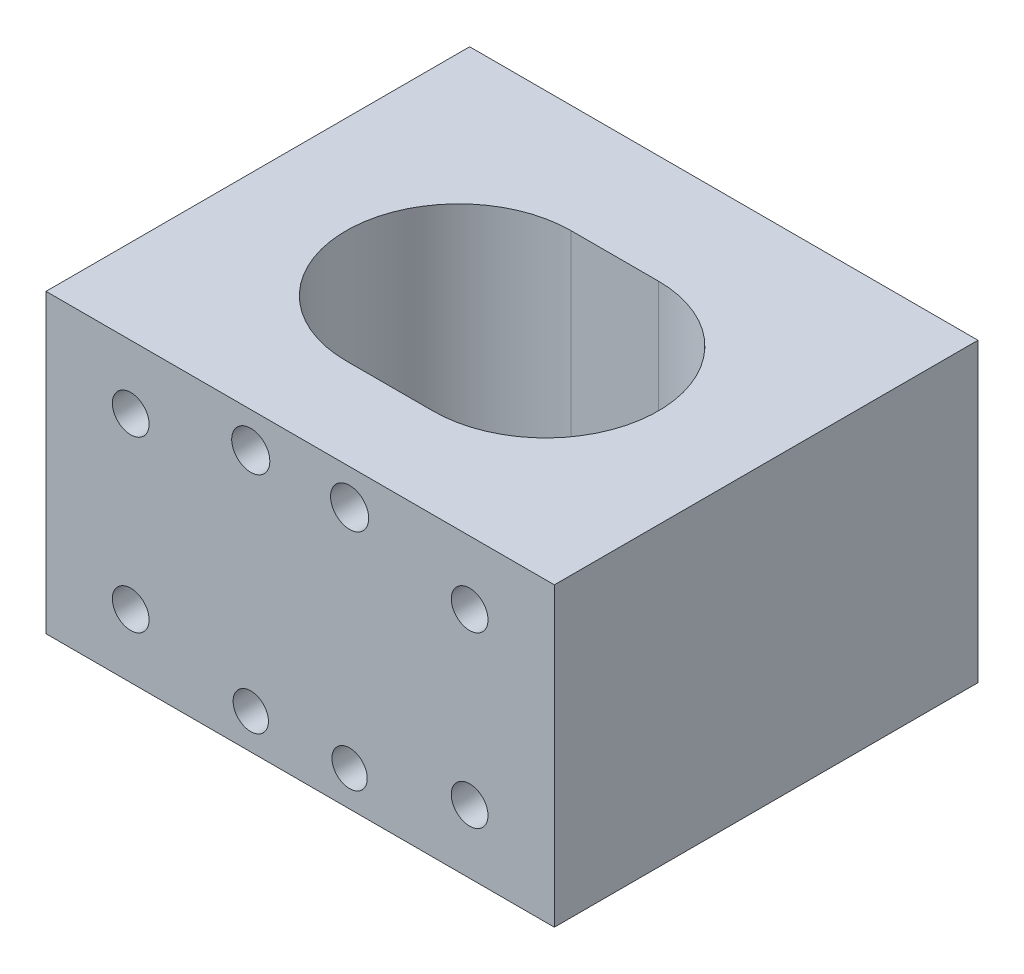
ISO-10303-21;
HEADER;
FILE_DESCRIPTION(('STEP AP214'),'2;1');
FILE_NAME('part.step','',(''),(''),'','','');
FILE_SCHEMA(('AUTOMOTIVE_DESIGN { 1 0 10303 214 1 1 1 1 }'));
ENDSEC;
DATA;
#1=APPLICATION_CONTEXT('core data for automotive mechanical design processes');
#2=APPLICATION_PROTOCOL_DEFINITION('international standard','automotive_design',2000,#1);
#3=PRODUCT_CONTEXT('',#1,'mechanical');
#4=PRODUCT('Part','Part','',(#3));
#5=PRODUCT_RELATED_PRODUCT_CATEGORY('part','',(#4));
#6=PRODUCT_DEFINITION_FORMATION('','',#4);
#7=PRODUCT_DEFINITION_CONTEXT('part definition',#1,'design');
#8=PRODUCT_DEFINITION('design','',#6,#7);
#9=PRODUCT_DEFINITION_SHAPE('','',#8);
#10=(LENGTH_UNIT() NAMED_UNIT(*) SI_UNIT(.MILLI.,.METRE.));
#11=(NAMED_UNIT(*) PLANE_ANGLE_UNIT() SI_UNIT($,.RADIAN.));
#12=(NAMED_UNIT(*) SI_UNIT($,.STERADIAN.) SOLID_ANGLE_UNIT());
#13=UNCERTAINTY_MEASURE_WITH_UNIT(LENGTH_MEASURE(1.E-05),#10,'distance_accuracy_value','');
#14=(GEOMETRIC_REPRESENTATION_CONTEXT(3) GLOBAL_UNCERTAINTY_ASSIGNED_CONTEXT((#13)) GLOBAL_UNIT_ASSIGNED_CONTEXT((#10,
#11,#12)) REPRESENTATION_CONTEXT('',''));
#15=CARTESIAN_POINT('',(0.,0.,0.));
#16=DIRECTION('',(0.,0.,1.));
#17=DIRECTION('',(1.,0.,0.));
#18=AXIS2_PLACEMENT_3D('',#15,#16,#17);
#19=CARTESIAN_POINT('',(0.,0.,0.));
#20=DIRECTION('',(0.,0.,1.));
#21=DIRECTION('',(1.,0.,0.));
#22=AXIS2_PLACEMENT_3D('',#19,#20,#21);
#23=PLANE('',#22);
#24=CARTESIAN_POINT('',(-3.5,-7.99999999999999,0.));
#25=DIRECTION('',(0.,0.,-1.));
#26=DIRECTION('',(-1.,0.,0.));
#27=AXIS2_PLACEMENT_3D('',#24,#25,#26);
#28=CIRCLE('',#27,1.25);
#29=CARTESIAN_POINT('',(-4.75,-7.99999999999999,0.));
#30=VERTEX_POINT('',#29);
#31=EDGE_CURVE('E195',#30,#30,#28,.T.);
#32=ORIENTED_EDGE('',*,*,#31,.F.);
#33=EDGE_LOOP('',(#32));
#34=FACE_BOUND('',#33,.T.);
#35=CARTESIAN_POINT('',(-12.,-5.99999999999999,0.));
#36=DIRECTION('',(0.,0.,1.));
#37=DIRECTION('',(1.,0.,0.));
#38=AXIS2_PLACEMENT_3D('',#35,#36,#37);
#39=CIRCLE('',#38,1.3);
#40=CARTESIAN_POINT('',(-10.7,-5.99999999999999,0.));
#41=VERTEX_POINT('',#40);
#42=EDGE_CURVE('E201',#41,#41,#39,.F.);
#43=ORIENTED_EDGE('',*,*,#42,.F.);
#44=EDGE_LOOP('',(#43));
#45=FACE_BOUND('',#44,.T.);
#46=CARTESIAN_POINT('',(-12.,6.,0.));
#47=DIRECTION('',(0.,0.,1.));
#48=DIRECTION('',(1.,0.,0.));
#49=AXIS2_PLACEMENT_3D('',#46,#47,#48);
#50=CIRCLE('',#49,1.3);
#51=CARTESIAN_POINT('',(-10.7,6.,0.));
#52=VERTEX_POINT('',#51);
#53=EDGE_CURVE('E207',#52,#52,#50,.F.);
#54=ORIENTED_EDGE('',*,*,#53,.F.);
#55=EDGE_LOOP('',(#54));
#56=FACE_BOUND('',#55,.T.);
#57=CARTESIAN_POINT('',(-3.5,8.,0.));
#58=DIRECTION('',(0.,0.,1.));
#59=DIRECTION('',(1.,0.,0.));
#60=AXIS2_PLACEMENT_3D('',#57,#58,#59);
#61=CIRCLE('',#60,1.35000000008995);
#62=CARTESIAN_POINT('',(-2.14999999991005,8.,0.));
#63=VERTEX_POINT('',#62);
#64=EDGE_CURVE('E213',#63,#63,#61,.F.);
#65=ORIENTED_EDGE('',*,*,#64,.F.);
#66=EDGE_LOOP('',(#65));
#67=FACE_BOUND('',#66,.T.);
#68=DIRECTION('',(0.,1.,0.));
#69=VECTOR('',#68,1.);
#70=CARTESIAN_POINT('',(-18.,0.,0.));
#71=LINE('',#70,#69);
#72=CARTESIAN_POINT('',(-18.,-10.5,0.));
#73=VERTEX_POINT('',#72);
#74=CARTESIAN_POINT('',(-18.,10.5,0.));
#75=VERTEX_POINT('',#74);
#76=EDGE_CURVE('E228',#73,#75,#71,.T.);
#77=ORIENTED_EDGE('',*,*,#76,.T.);
#78=DIRECTION('',(-1.,0.,0.));
#79=VECTOR('',#78,1.);
#80=CARTESIAN_POINT('',(0.,10.5,0.));
#81=LINE('',#80,#79);
#82=CARTESIAN_POINT('',(18.,10.5,0.));
#83=VERTEX_POINT('',#82);
#84=EDGE_CURVE('E235',#83,#75,#81,.T.);
#85=ORIENTED_EDGE('',*,*,#84,.F.);
#86=DIRECTION('',(0.,1.,0.));
#87=VECTOR('',#86,1.);
#88=CARTESIAN_POINT('',(18.,0.,0.));
#89=LINE('',#88,#87);
#90=CARTESIAN_POINT('',(18.,-10.5,0.));
#91=VERTEX_POINT('',#90);
#92=EDGE_CURVE('E248',#91,#83,#89,.T.);
#93=ORIENTED_EDGE('',*,*,#92,.F.);
#94=DIRECTION('',(-1.,0.,0.));
#95=VECTOR('',#94,1.);
#96=CARTESIAN_POINT('',(0.,-10.5,0.));
#97=LINE('',#96,#95);
#98=EDGE_CURVE('E245',#91,#73,#97,.T.);
#99=ORIENTED_EDGE('',*,*,#98,.T.);
#100=EDGE_LOOP('',(#77,#85,#93,#99));
#101=FACE_BOUND('',#100,.T.);
#102=CARTESIAN_POINT('',(12.,6.,0.));
#103=DIRECTION('',(0.,0.,1.));
#104=DIRECTION('',(1.,0.,0.));
#105=AXIS2_PLACEMENT_3D('',#102,#103,#104);
#106=CIRCLE('',#105,1.3);
#107=CARTESIAN_POINT('',(13.3,6.,0.));
#108=VERTEX_POINT('',#107);
#109=EDGE_CURVE('E222',#108,#108,#106,.T.);
#110=ORIENTED_EDGE('',*,*,#109,.T.);
#111=EDGE_LOOP('',(#110));
#112=FACE_BOUND('',#111,.T.);
#113=CARTESIAN_POINT('',(3.5,8.,0.));
#114=DIRECTION('',(0.,0.,1.));
#115=DIRECTION('',(1.,0.,0.));
#116=AXIS2_PLACEMENT_3D('',#113,#114,#115);
#117=CIRCLE('',#116,1.35000000008995);
#118=CARTESIAN_POINT('',(4.85000000008995,8.,0.));
#119=VERTEX_POINT('',#118);
#120=EDGE_CURVE('E219',#119,#119,#117,.T.);
#121=ORIENTED_EDGE('',*,*,#120,.T.);
#122=EDGE_LOOP('',(#121));
#123=FACE_BOUND('',#122,.T.);
#124=CARTESIAN_POINT('',(3.5,-8.,0.));
#125=DIRECTION('',(0.,0.,1.));
#126=DIRECTION('',(1.,0.,0.));
#127=AXIS2_PLACEMENT_3D('',#124,#125,#126);
#128=CIRCLE('',#127,1.25);
#129=CARTESIAN_POINT('',(4.75,-8.,0.));
#130=VERTEX_POINT('',#129);
#131=EDGE_CURVE('E189',#130,#130,#128,.T.);
#132=ORIENTED_EDGE('',*,*,#131,.T.);
#133=EDGE_LOOP('',(#132));
#134=FACE_BOUND('',#133,.T.);
#135=CARTESIAN_POINT('',(12.,-6.,0.));
#136=DIRECTION('',(0.,0.,1.));
#137=DIRECTION('',(1.,0.,0.));
#138=AXIS2_PLACEMENT_3D('',#135,#136,#137);
#139=CIRCLE('',#138,1.3);
#140=CARTESIAN_POINT('',(13.3,-6.,0.));
#141=VERTEX_POINT('',#140);
#142=EDGE_CURVE('E183',#141,#141,#139,.T.);
#143=ORIENTED_EDGE('',*,*,#142,.T.);
#144=EDGE_LOOP('',(#143));
#145=FACE_BOUND('',#144,.T.);
#146=ADVANCED_FACE('F34',(#34,#45,#56,#67,#101,#112,#123,#134,#145),#23,.F.);
#147=CARTESIAN_POINT('',(-18.,0.,30.));
#148=DIRECTION('',(-1.,0.,0.));
#149=DIRECTION('',(0.,0.,1.));
#150=AXIS2_PLACEMENT_3D('',#147,#148,#149);
#151=PLANE('',#150);
#152=ORIENTED_EDGE('',*,*,#76,.F.);
#153=DIRECTION('',(0.,0.,-1.));
#154=VECTOR('',#153,1.);
#155=CARTESIAN_POINT('',(-18.,-10.5,30.));
#156=LINE('',#155,#154);
#157=CARTESIAN_POINT('',(-18.,-10.5,30.));
#158=VERTEX_POINT('',#157);
#159=EDGE_CURVE('E11',#158,#73,#156,.T.);
#160=ORIENTED_EDGE('',*,*,#159,.F.);
#161=DIRECTION('',(0.,1.,0.));
#162=VECTOR('',#161,1.);
#163=CARTESIAN_POINT('',(-18.,0.,30.));
#164=LINE('',#163,#162);
#165=CARTESIAN_POINT('',(-18.,10.5,30.));
#166=VERTEX_POINT('',#165);
#167=EDGE_CURVE('E231',#158,#166,#164,.T.);
#168=ORIENTED_EDGE('',*,*,#167,.T.);
#169=DIRECTION('',(0.,0.,-1.));
#170=VECTOR('',#169,1.);
#171=CARTESIAN_POINT('',(-18.,10.5,30.));
#172=LINE('',#171,#170);
#173=EDGE_CURVE('E242',#166,#75,#172,.T.);
#174=ORIENTED_EDGE('',*,*,#173,.T.);
#175=EDGE_LOOP('',(#152,#160,#168,#174));
#176=FACE_BOUND('',#175,.T.);
#177=ADVANCED_FACE('F36',(#176),#151,.T.);
#178=CARTESIAN_POINT('',(0.,-10.5,30.));
#179=DIRECTION('',(0.,-1.,0.));
#180=DIRECTION('',(0.,0.,-1.));
#181=AXIS2_PLACEMENT_3D('',#178,#179,#180);
#182=PLANE('',#181);
#183=CARTESIAN_POINT('',(-3.11801892453334,-10.5,15.6626702878832));
#184=DIRECTION('',(0.,-1.,0.));
#185=DIRECTION('',(0.,0.,-1.));
#186=AXIS2_PLACEMENT_3D('',#183,#184,#185);
#187=CIRCLE('',#186,7.97528862669013);
#188=CARTESIAN_POINT('',(-3.11801892453334,-10.5,23.6379589145733));
#189=VERTEX_POINT('',#188);
#190=CARTESIAN_POINT('',(-3.11801892453334,-10.5,7.68738166119304));
#191=VERTEX_POINT('',#190);
#192=EDGE_CURVE('E132',#189,#191,#187,.T.);
#193=ORIENTED_EDGE('',*,*,#192,.F.);
#194=DIRECTION('',(-1.,0.,0.));
#195=VECTOR('',#194,1.);
#196=CARTESIAN_POINT('',(0.,-10.5,23.6379589145733));
#197=LINE('',#196,#195);
#198=CARTESIAN_POINT('',(3.04470410518176,-10.5,23.6379589145733));
#199=VERTEX_POINT('',#198);
#200=EDGE_CURVE('E124',#199,#189,#197,.T.);
#201=ORIENTED_EDGE('',*,*,#200,.F.);
#202=CARTESIAN_POINT('',(3.04470410518176,-10.5,15.6626702878832));
#203=DIRECTION('',(0.,-1.,0.));
#204=DIRECTION('',(0.,0.,-1.));
#205=AXIS2_PLACEMENT_3D('',#202,#203,#204);
#206=CIRCLE('',#205,7.97528862669013);
#207=CARTESIAN_POINT('',(3.04470410518176,-10.5,7.68738166119304));
#208=VERTEX_POINT('',#207);
#209=EDGE_CURVE('E104',#208,#199,#206,.T.);
#210=ORIENTED_EDGE('',*,*,#209,.F.);
#211=DIRECTION('',(-1.,0.,0.));
#212=VECTOR('',#211,1.);
#213=CARTESIAN_POINT('',(0.,-10.5,7.68738166119304));
#214=LINE('',#213,#212);
#215=EDGE_CURVE('E129',#208,#191,#214,.T.);
#216=ORIENTED_EDGE('',*,*,#215,.T.);
#217=EDGE_LOOP('',(#193,#201,#210,#216));
#218=FACE_BOUND('',#217,.T.);
#219=ORIENTED_EDGE('',*,*,#98,.F.);
#220=DIRECTION('',(0.,0.,-1.));
#221=VECTOR('',#220,1.);
#222=CARTESIAN_POINT('',(18.,-10.5,30.));
#223=LINE('',#222,#221);
#224=CARTESIAN_POINT('',(18.,-10.5,30.));
#225=VERTEX_POINT('',#224);
#226=EDGE_CURVE('E42',#225,#91,#223,.T.);
#227=ORIENTED_EDGE('',*,*,#226,.F.);
#228=DIRECTION('',(-1.,0.,0.));
#229=VECTOR('',#228,1.);
#230=CARTESIAN_POINT('',(0.,-10.5,30.));
#231=LINE('',#230,#229);
#232=EDGE_CURVE('E234',#225,#158,#231,.T.);
#233=ORIENTED_EDGE('',*,*,#232,.T.);
#234=ORIENTED_EDGE('',*,*,#159,.T.);
#235=EDGE_LOOP('',(#219,#227,#233,#234));
#236=FACE_BOUND('',#235,.T.);
#237=ADVANCED_FACE('F266',(#218,#236),#182,.T.);
#238=CARTESIAN_POINT('',(18.,0.,30.));
#239=DIRECTION('',(-1.,0.,0.));
#240=DIRECTION('',(0.,0.,1.));
#241=AXIS2_PLACEMENT_3D('',#238,#239,#240);
#242=PLANE('',#241);
#243=ORIENTED_EDGE('',*,*,#92,.T.);
#244=DIRECTION('',(0.,0.,-1.));
#245=VECTOR('',#244,1.);
#246=CARTESIAN_POINT('',(18.,10.5,30.));
#247=LINE('',#246,#245);
#248=CARTESIAN_POINT('',(18.,10.5,30.));
#249=VERTEX_POINT('',#248);
#250=EDGE_CURVE('E253',#249,#83,#247,.T.);
#251=ORIENTED_EDGE('',*,*,#250,.F.);
#252=DIRECTION('',(0.,1.,0.));
#253=VECTOR('',#252,1.);
#254=CARTESIAN_POINT('',(18.,0.,30.));
#255=LINE('',#254,#253);
#256=EDGE_CURVE('E238',#225,#249,#255,.T.);
#257=ORIENTED_EDGE('',*,*,#256,.F.);
#258=ORIENTED_EDGE('',*,*,#226,.T.);
#259=EDGE_LOOP('',(#243,#251,#257,#258));
#260=FACE_BOUND('',#259,.T.);
#261=ADVANCED_FACE('F258',(#260),#242,.F.);
#262=CARTESIAN_POINT('',(0.,10.5,30.));
#263=DIRECTION('',(0.,-1.,0.));
#264=DIRECTION('',(0.,0.,-1.));
#265=AXIS2_PLACEMENT_3D('',#262,#263,#264);
#266=PLANE('',#265);
#267=DIRECTION('',(1.,0.,0.));
#268=VECTOR('',#267,1.);
#269=CARTESIAN_POINT('',(-3.11801892453334,10.5,23.6379589145733));
#270=LINE('',#269,#268);
#271=CARTESIAN_POINT('',(-3.11801892453334,10.5,23.6379589145733));
#272=VERTEX_POINT('',#271);
#273=CARTESIAN_POINT('',(3.04470410518176,10.5,23.6379589145733));
#274=VERTEX_POINT('',#273);
#275=EDGE_CURVE('E110',#272,#274,#270,.T.);
#276=ORIENTED_EDGE('',*,*,#275,.F.);
#277=CARTESIAN_POINT('',(-3.11801892453334,10.5,15.6626702878832));
#278=DIRECTION('',(0.,1.,0.));
#279=DIRECTION('',(0.,0.,1.));
#280=AXIS2_PLACEMENT_3D('',#277,#278,#279);
#281=CIRCLE('',#280,7.97528862669013);
#282=CARTESIAN_POINT('',(-3.11801892453334,10.5,7.68738166119304));
#283=VERTEX_POINT('',#282);
#284=EDGE_CURVE('E57',#283,#272,#281,.T.);
#285=ORIENTED_EDGE('',*,*,#284,.F.);
#286=DIRECTION('',(1.,0.,0.));
#287=VECTOR('',#286,1.);
#288=CARTESIAN_POINT('',(-3.11801892453334,10.5,7.68738166119304));
#289=LINE('',#288,#287);
#290=CARTESIAN_POINT('',(3.04470410518176,10.5,7.68738166119304));
#291=VERTEX_POINT('',#290);
#292=EDGE_CURVE('E117',#283,#291,#289,.T.);
#293=ORIENTED_EDGE('',*,*,#292,.T.);
#294=CARTESIAN_POINT('',(3.04470410518176,10.5,15.6626702878832));
#295=DIRECTION('',(0.,1.,0.));
#296=DIRECTION('',(0.,0.,1.));
#297=AXIS2_PLACEMENT_3D('',#294,#295,#296);
#298=CIRCLE('',#297,7.97528862669013);
#299=EDGE_CURVE('E101',#274,#291,#298,.T.);
#300=ORIENTED_EDGE('',*,*,#299,.F.);
#301=EDGE_LOOP('',(#276,#285,#293,#300));
#302=FACE_BOUND('',#301,.T.);
#303=ORIENTED_EDGE('',*,*,#84,.T.);
#304=ORIENTED_EDGE('',*,*,#173,.F.);
#305=DIRECTION('',(-1.,0.,0.));
#306=VECTOR('',#305,1.);
#307=CARTESIAN_POINT('',(0.,10.5,30.));
#308=LINE('',#307,#306);
#309=EDGE_CURVE('E240',#249,#166,#308,.T.);
#310=ORIENTED_EDGE('',*,*,#309,.F.);
#311=ORIENTED_EDGE('',*,*,#250,.T.);
#312=EDGE_LOOP('',(#303,#304,#310,#311));
#313=FACE_BOUND('',#312,.T.);
#314=ADVANCED_FACE('F114',(#302,#313),#266,.F.);
#315=CARTESIAN_POINT('',(0.,0.,30.));
#316=DIRECTION('',(0.,0.,1.));
#317=DIRECTION('',(1.,0.,0.));
#318=AXIS2_PLACEMENT_3D('',#315,#316,#317);
#319=PLANE('',#318);
#320=CARTESIAN_POINT('',(12.,-6.,30.));
#321=DIRECTION('',(0.,0.,1.));
#322=DIRECTION('',(1.,0.,0.));
#323=AXIS2_PLACEMENT_3D('',#320,#321,#322);
#324=CIRCLE('',#323,1.3);
#325=CARTESIAN_POINT('',(13.3,-6.,30.));
#326=VERTEX_POINT('',#325);
#327=EDGE_CURVE('E134',#326,#326,#324,.T.);
#328=ORIENTED_EDGE('',*,*,#327,.F.);
#329=EDGE_LOOP('',(#328));
#330=FACE_BOUND('',#329,.T.);
#331=CARTESIAN_POINT('',(3.5,-8.,30.));
#332=DIRECTION('',(0.,0.,1.));
#333=DIRECTION('',(1.,0.,0.));
#334=AXIS2_PLACEMENT_3D('',#331,#332,#333);
#335=CIRCLE('',#334,1.25);
#336=CARTESIAN_POINT('',(4.75,-8.,30.));
#337=VERTEX_POINT('',#336);
#338=EDGE_CURVE('E138',#337,#337,#335,.T.);
#339=ORIENTED_EDGE('',*,*,#338,.F.);
#340=EDGE_LOOP('',(#339));
#341=FACE_BOUND('',#340,.T.);
#342=CARTESIAN_POINT('',(-3.5,-7.99999999999999,30.));
#343=DIRECTION('',(0.,0.,1.));
#344=DIRECTION('',(1.,0.,0.));
#345=AXIS2_PLACEMENT_3D('',#342,#343,#344);
#346=CIRCLE('',#345,1.25);
#347=CARTESIAN_POINT('',(-2.25,-7.99999999999999,30.));
#348=VERTEX_POINT('',#347);
#349=EDGE_CURVE('E144',#348,#348,#346,.T.);
#350=ORIENTED_EDGE('',*,*,#349,.F.);
#351=EDGE_LOOP('',(#350));
#352=FACE_BOUND('',#351,.T.);
#353=CARTESIAN_POINT('',(-12.,-5.99999999999999,30.));
#354=DIRECTION('',(0.,0.,1.));
#355=DIRECTION('',(1.,0.,0.));
#356=AXIS2_PLACEMENT_3D('',#353,#354,#355);
#357=CIRCLE('',#356,1.3);
#358=CARTESIAN_POINT('',(-10.7,-5.99999999999999,30.));
#359=VERTEX_POINT('',#358);
#360=EDGE_CURVE('E150',#359,#359,#357,.T.);
#361=ORIENTED_EDGE('',*,*,#360,.F.);
#362=EDGE_LOOP('',(#361));
#363=FACE_BOUND('',#362,.T.);
#364=CARTESIAN_POINT('',(-12.,6.,30.));
#365=DIRECTION('',(0.,0.,1.));
#366=DIRECTION('',(1.,0.,0.));
#367=AXIS2_PLACEMENT_3D('',#364,#365,#366);
#368=CIRCLE('',#367,1.3);
#369=CARTESIAN_POINT('',(-10.7,6.,30.));
#370=VERTEX_POINT('',#369);
#371=EDGE_CURVE('E156',#370,#370,#368,.T.);
#372=ORIENTED_EDGE('',*,*,#371,.F.);
#373=EDGE_LOOP('',(#372));
#374=FACE_BOUND('',#373,.T.);
#375=CARTESIAN_POINT('',(-3.5,8.,30.));
#376=DIRECTION('',(0.,0.,1.));
#377=DIRECTION('',(1.,0.,0.));
#378=AXIS2_PLACEMENT_3D('',#375,#376,#377);
#379=CIRCLE('',#378,1.35000000008995);
#380=CARTESIAN_POINT('',(-2.14999999991005,8.,30.));
#381=VERTEX_POINT('',#380);
#382=EDGE_CURVE('E162',#381,#381,#379,.T.);
#383=ORIENTED_EDGE('',*,*,#382,.F.);
#384=EDGE_LOOP('',(#383));
#385=FACE_BOUND('',#384,.T.);
#386=CARTESIAN_POINT('',(12.,6.,30.));
#387=DIRECTION('',(0.,0.,1.));
#388=DIRECTION('',(1.,0.,0.));
#389=AXIS2_PLACEMENT_3D('',#386,#387,#388);
#390=CIRCLE('',#389,1.3);
#391=CARTESIAN_POINT('',(13.3,6.,30.));
#392=VERTEX_POINT('',#391);
#393=EDGE_CURVE('E168',#392,#392,#390,.T.);
#394=ORIENTED_EDGE('',*,*,#393,.F.);
#395=EDGE_LOOP('',(#394));
#396=FACE_BOUND('',#395,.T.);
#397=CARTESIAN_POINT('',(3.5,8.,30.));
#398=DIRECTION('',(0.,0.,1.));
#399=DIRECTION('',(1.,0.,0.));
#400=AXIS2_PLACEMENT_3D('',#397,#398,#399);
#401=CIRCLE('',#400,1.35000000008995);
#402=CARTESIAN_POINT('',(4.85000000008995,8.,30.));
#403=VERTEX_POINT('',#402);
#404=EDGE_CURVE('E174',#403,#403,#401,.T.);
#405=ORIENTED_EDGE('',*,*,#404,.F.);
#406=EDGE_LOOP('',(#405));
#407=FACE_BOUND('',#406,.T.);
#408=ORIENTED_EDGE('',*,*,#167,.F.);
#409=ORIENTED_EDGE('',*,*,#232,.F.);
#410=ORIENTED_EDGE('',*,*,#256,.T.);
#411=ORIENTED_EDGE('',*,*,#309,.T.);
#412=EDGE_LOOP('',(#408,#409,#410,#411));
#413=FACE_BOUND('',#412,.T.);
#414=ADVANCED_FACE('F273',(#330,#341,#352,#363,#374,#385,#396,#407,#413),#319,.T.);
#415=CARTESIAN_POINT('',(12.,6.,4.));
#416=DIRECTION('',(0.,0.,-1.));
#417=DIRECTION('',(-1.,0.,0.));
#418=AXIS2_PLACEMENT_3D('',#415,#416,#417);
#419=CYLINDRICAL_SURFACE('',#418,1.3);
#420=CARTESIAN_POINT('',(12.,6.,4.));
#421=DIRECTION('',(0.,0.,1.));
#422=DIRECTION('',(1.,0.,0.));
#423=AXIS2_PLACEMENT_3D('',#420,#421,#422);
#424=CIRCLE('',#423,1.3);
#425=CARTESIAN_POINT('',(13.3,6.,4.));
#426=VERTEX_POINT('',#425);
#427=EDGE_CURVE('E225',#426,#426,#424,.T.);
#428=ORIENTED_EDGE('',*,*,#427,.T.);
#429=EDGE_LOOP('',(#428));
#430=FACE_BOUND('',#429,.T.);
#431=ORIENTED_EDGE('',*,*,#109,.F.);
#432=EDGE_LOOP('',(#431));
#433=FACE_BOUND('',#432,.T.);
#434=ADVANCED_FACE('F275',(#430,#433),#419,.F.);
#435=CARTESIAN_POINT('',(0.,0.,4.));
#436=DIRECTION('',(0.,0.,1.));
#437=DIRECTION('',(1.,0.,0.));
#438=AXIS2_PLACEMENT_3D('',#435,#436,#437);
#439=PLANE('',#438);
#440=ORIENTED_EDGE('',*,*,#427,.F.);
#441=EDGE_LOOP('',(#440));
#442=FACE_BOUND('',#441,.T.);
#443=ADVANCED_FACE('F282',(#442),#439,.F.);
#444=CARTESIAN_POINT('',(3.5,8.,4.));
#445=DIRECTION('',(0.,0.,-1.));
#446=DIRECTION('',(-1.,0.,0.));
#447=AXIS2_PLACEMENT_3D('',#444,#445,#446);
#448=CYLINDRICAL_SURFACE('',#447,1.35000000008995);
#449=CARTESIAN_POINT('',(3.5,8.,4.));
#450=DIRECTION('',(0.,0.,1.));
#451=DIRECTION('',(1.,0.,0.));
#452=AXIS2_PLACEMENT_3D('',#449,#450,#451);
#453=CIRCLE('',#452,1.35000000008995);
#454=CARTESIAN_POINT('',(4.85000000008995,8.,4.));
#455=VERTEX_POINT('',#454);
#456=EDGE_CURVE('E216',#455,#455,#453,.T.);
#457=ORIENTED_EDGE('',*,*,#456,.T.);
#458=EDGE_LOOP('',(#457));
#459=FACE_BOUND('',#458,.T.);
#460=ORIENTED_EDGE('',*,*,#120,.F.);
#461=EDGE_LOOP('',(#460));
#462=FACE_BOUND('',#461,.T.);
#463=ADVANCED_FACE('F431',(#459,#462),#448,.F.);
#464=CARTESIAN_POINT('',(0.,0.,4.));
#465=DIRECTION('',(0.,0.,1.));
#466=DIRECTION('',(1.,0.,0.));
#467=AXIS2_PLACEMENT_3D('',#464,#465,#466);
#468=PLANE('',#467);
#469=ORIENTED_EDGE('',*,*,#456,.F.);
#470=EDGE_LOOP('',(#469));
#471=FACE_BOUND('',#470,.T.);
#472=ADVANCED_FACE('F426',(#471),#468,.F.);
#473=CARTESIAN_POINT('',(-3.5,8.,4.));
#474=DIRECTION('',(0.,0.,-1.));
#475=DIRECTION('',(-1.,0.,0.));
#476=AXIS2_PLACEMENT_3D('',#473,#474,#475);
#477=CYLINDRICAL_SURFACE('',#476,1.35000000008995);
#478=CARTESIAN_POINT('',(-3.5,8.,4.));
#479=DIRECTION('',(0.,0.,1.));
#480=DIRECTION('',(1.,0.,0.));
#481=AXIS2_PLACEMENT_3D('',#478,#479,#480);
#482=CIRCLE('',#481,1.35000000008995);
#483=CARTESIAN_POINT('',(-2.14999999991005,8.,4.));
#484=VERTEX_POINT('',#483);
#485=EDGE_CURVE('E210',#484,#484,#482,.F.);
#486=ORIENTED_EDGE('',*,*,#485,.F.);
#487=EDGE_LOOP('',(#486));
#488=FACE_BOUND('',#487,.T.);
#489=ORIENTED_EDGE('',*,*,#64,.T.);
#490=EDGE_LOOP('',(#489));
#491=FACE_BOUND('',#490,.T.);
#492=ADVANCED_FACE('F423',(#488,#491),#477,.F.);
#493=CARTESIAN_POINT('',(0.,0.,4.));
#494=DIRECTION('',(0.,0.,1.));
#495=DIRECTION('',(1.,0.,0.));
#496=AXIS2_PLACEMENT_3D('',#493,#494,#495);
#497=PLANE('',#496);
#498=ORIENTED_EDGE('',*,*,#485,.T.);
#499=EDGE_LOOP('',(#498));
#500=FACE_BOUND('',#499,.T.);
#501=ADVANCED_FACE('F418',(#500),#497,.F.);
#502=CARTESIAN_POINT('',(-12.,6.,4.));
#503=DIRECTION('',(0.,0.,-1.));
#504=DIRECTION('',(-1.,0.,0.));
#505=AXIS2_PLACEMENT_3D('',#502,#503,#504);
#506=CYLINDRICAL_SURFACE('',#505,1.3);
#507=CARTESIAN_POINT('',(-12.,6.,4.));
#508=DIRECTION('',(0.,0.,1.));
#509=DIRECTION('',(1.,0.,0.));
#510=AXIS2_PLACEMENT_3D('',#507,#508,#509);
#511=CIRCLE('',#510,1.3);
#512=CARTESIAN_POINT('',(-10.7,6.,4.));
#513=VERTEX_POINT('',#512);
#514=EDGE_CURVE('E204',#513,#513,#511,.F.);
#515=ORIENTED_EDGE('',*,*,#514,.F.);
#516=EDGE_LOOP('',(#515));
#517=FACE_BOUND('',#516,.T.);
#518=ORIENTED_EDGE('',*,*,#53,.T.);
#519=EDGE_LOOP('',(#518));
#520=FACE_BOUND('',#519,.T.);
#521=ADVANCED_FACE('F415',(#517,#520),#506,.F.);
#522=CARTESIAN_POINT('',(0.,0.,4.));
#523=DIRECTION('',(0.,0.,1.));
#524=DIRECTION('',(1.,0.,0.));
#525=AXIS2_PLACEMENT_3D('',#522,#523,#524);
#526=PLANE('',#525);
#527=ORIENTED_EDGE('',*,*,#514,.T.);
#528=EDGE_LOOP('',(#527));
#529=FACE_BOUND('',#528,.T.);
#530=ADVANCED_FACE('F410',(#529),#526,.F.);
#531=CARTESIAN_POINT('',(-12.,-5.99999999999999,4.));
#532=DIRECTION('',(0.,0.,-1.));
#533=DIRECTION('',(-1.,0.,0.));
#534=AXIS2_PLACEMENT_3D('',#531,#532,#533);
#535=CYLINDRICAL_SURFACE('',#534,1.3);
#536=CARTESIAN_POINT('',(-12.,-5.99999999999999,4.));
#537=DIRECTION('',(0.,0.,1.));
#538=DIRECTION('',(1.,0.,0.));
#539=AXIS2_PLACEMENT_3D('',#536,#537,#538);
#540=CIRCLE('',#539,1.3);
#541=CARTESIAN_POINT('',(-10.7,-5.99999999999999,4.));
#542=VERTEX_POINT('',#541);
#543=EDGE_CURVE('E198',#542,#542,#540,.F.);
#544=ORIENTED_EDGE('',*,*,#543,.F.);
#545=EDGE_LOOP('',(#544));
#546=FACE_BOUND('',#545,.T.);
#547=ORIENTED_EDGE('',*,*,#42,.T.);
#548=EDGE_LOOP('',(#547));
#549=FACE_BOUND('',#548,.T.);
#550=ADVANCED_FACE('F407',(#546,#549),#535,.F.);
#551=CARTESIAN_POINT('',(0.,0.,4.));
#552=DIRECTION('',(0.,0.,1.));
#553=DIRECTION('',(1.,0.,0.));
#554=AXIS2_PLACEMENT_3D('',#551,#552,#553);
#555=PLANE('',#554);
#556=ORIENTED_EDGE('',*,*,#543,.T.);
#557=EDGE_LOOP('',(#556));
#558=FACE_BOUND('',#557,.T.);
#559=ADVANCED_FACE('F402',(#558),#555,.F.);
#560=CARTESIAN_POINT('',(-3.5,-7.99999999999999,4.));
#561=DIRECTION('',(0.,0.,-1.));
#562=DIRECTION('',(-1.,0.,0.));
#563=AXIS2_PLACEMENT_3D('',#560,#561,#562);
#564=CYLINDRICAL_SURFACE('',#563,1.25);
#565=CARTESIAN_POINT('',(-3.5,-7.99999999999999,4.));
#566=DIRECTION('',(0.,0.,-1.));
#567=DIRECTION('',(-1.,0.,0.));
#568=AXIS2_PLACEMENT_3D('',#565,#566,#567);
#569=CIRCLE('',#568,1.25);
#570=CARTESIAN_POINT('',(-4.75,-7.99999999999999,4.));
#571=VERTEX_POINT('',#570);
#572=EDGE_CURVE('E192',#571,#571,#569,.T.);
#573=ORIENTED_EDGE('',*,*,#572,.F.);
#574=EDGE_LOOP('',(#573));
#575=FACE_BOUND('',#574,.T.);
#576=ORIENTED_EDGE('',*,*,#31,.T.);
#577=EDGE_LOOP('',(#576));
#578=FACE_BOUND('',#577,.T.);
#579=ADVANCED_FACE('F399',(#575,#578),#564,.F.);
#580=CARTESIAN_POINT('',(-3.5,-7.99999999999999,4.));
#581=DIRECTION('',(0.,0.,-1.));
#582=DIRECTION('',(-1.,0.,0.));
#583=AXIS2_PLACEMENT_3D('',#580,#581,#582);
#584=PLANE('',#583);
#585=ORIENTED_EDGE('',*,*,#572,.T.);
#586=EDGE_LOOP('',(#585));
#587=FACE_BOUND('',#586,.T.);
#588=ADVANCED_FACE('F394',(#587),#584,.T.);
#589=CARTESIAN_POINT('',(3.5,-8.,4.));
#590=DIRECTION('',(0.,0.,-1.));
#591=DIRECTION('',(-1.,0.,0.));
#592=AXIS2_PLACEMENT_3D('',#589,#590,#591);
#593=CYLINDRICAL_SURFACE('',#592,1.25);
#594=CARTESIAN_POINT('',(3.5,-8.,4.));
#595=DIRECTION('',(0.,0.,1.));
#596=DIRECTION('',(1.,0.,0.));
#597=AXIS2_PLACEMENT_3D('',#594,#595,#596);
#598=CIRCLE('',#597,1.25);
#599=CARTESIAN_POINT('',(4.75,-8.,4.));
#600=VERTEX_POINT('',#599);
#601=EDGE_CURVE('E186',#600,#600,#598,.T.);
#602=ORIENTED_EDGE('',*,*,#601,.T.);
#603=EDGE_LOOP('',(#602));
#604=FACE_BOUND('',#603,.T.);
#605=ORIENTED_EDGE('',*,*,#131,.F.);
#606=EDGE_LOOP('',(#605));
#607=FACE_BOUND('',#606,.T.);
#608=ADVANCED_FACE('F391',(#604,#607),#593,.F.);
#609=CARTESIAN_POINT('',(3.5,-8.,4.));
#610=DIRECTION('',(0.,0.,1.));
#611=DIRECTION('',(1.,0.,0.));
#612=AXIS2_PLACEMENT_3D('',#609,#610,#611);
#613=PLANE('',#612);
#614=ORIENTED_EDGE('',*,*,#601,.F.);
#615=EDGE_LOOP('',(#614));
#616=FACE_BOUND('',#615,.T.);
#617=ADVANCED_FACE('F386',(#616),#613,.F.);
#618=CARTESIAN_POINT('',(12.,-6.,4.));
#619=DIRECTION('',(0.,0.,-1.));
#620=DIRECTION('',(-1.,0.,0.));
#621=AXIS2_PLACEMENT_3D('',#618,#619,#620);
#622=CYLINDRICAL_SURFACE('',#621,1.3);
#623=CARTESIAN_POINT('',(12.,-6.,4.));
#624=DIRECTION('',(0.,0.,1.));
#625=DIRECTION('',(1.,0.,0.));
#626=AXIS2_PLACEMENT_3D('',#623,#624,#625);
#627=CIRCLE('',#626,1.3);
#628=CARTESIAN_POINT('',(13.3,-6.,4.));
#629=VERTEX_POINT('',#628);
#630=EDGE_CURVE('E180',#629,#629,#627,.T.);
#631=ORIENTED_EDGE('',*,*,#630,.T.);
#632=EDGE_LOOP('',(#631));
#633=FACE_BOUND('',#632,.T.);
#634=ORIENTED_EDGE('',*,*,#142,.F.);
#635=EDGE_LOOP('',(#634));
#636=FACE_BOUND('',#635,.T.);
#637=ADVANCED_FACE('F383',(#633,#636),#622,.F.);
#638=CARTESIAN_POINT('',(12.,-6.,4.));
#639=DIRECTION('',(0.,0.,1.));
#640=DIRECTION('',(1.,0.,0.));
#641=AXIS2_PLACEMENT_3D('',#638,#639,#640);
#642=PLANE('',#641);
#643=ORIENTED_EDGE('',*,*,#630,.F.);
#644=EDGE_LOOP('',(#643));
#645=FACE_BOUND('',#644,.T.);
#646=ADVANCED_FACE('F381',(#645),#642,.F.);
#647=CARTESIAN_POINT('',(3.5,8.,26.));
#648=DIRECTION('',(0.,0.,1.));
#649=DIRECTION('',(1.,0.,0.));
#650=AXIS2_PLACEMENT_3D('',#647,#648,#649);
#651=CYLINDRICAL_SURFACE('',#650,1.35000000008995);
#652=CARTESIAN_POINT('',(3.5,8.,26.));
#653=DIRECTION('',(0.,0.,1.));
#654=DIRECTION('',(1.,0.,0.));
#655=AXIS2_PLACEMENT_3D('',#652,#653,#654);
#656=CIRCLE('',#655,1.35000000008995);
#657=CARTESIAN_POINT('',(4.85000000008995,8.,26.));
#658=VERTEX_POINT('',#657);
#659=EDGE_CURVE('E177',#658,#658,#656,.T.);
#660=ORIENTED_EDGE('',*,*,#659,.F.);
#661=EDGE_LOOP('',(#660));
#662=FACE_BOUND('',#661,.T.);
#663=ORIENTED_EDGE('',*,*,#404,.T.);
#664=EDGE_LOOP('',(#663));
#665=FACE_BOUND('',#664,.T.);
#666=ADVANCED_FACE('F377',(#662,#665),#651,.F.);
#667=CARTESIAN_POINT('',(3.5,8.,26.));
#668=DIRECTION('',(0.,0.,1.));
#669=DIRECTION('',(1.,0.,0.));
#670=AXIS2_PLACEMENT_3D('',#667,#668,#669);
#671=PLANE('',#670);
#672=ORIENTED_EDGE('',*,*,#659,.T.);
#673=EDGE_LOOP('',(#672));
#674=FACE_BOUND('',#673,.T.);
#675=ADVANCED_FACE('F373',(#674),#671,.T.);
#676=CARTESIAN_POINT('',(12.,6.,26.));
#677=DIRECTION('',(0.,0.,1.));
#678=DIRECTION('',(1.,0.,0.));
#679=AXIS2_PLACEMENT_3D('',#676,#677,#678);
#680=CYLINDRICAL_SURFACE('',#679,1.3);
#681=CARTESIAN_POINT('',(12.,6.,26.));
#682=DIRECTION('',(0.,0.,1.));
#683=DIRECTION('',(1.,0.,0.));
#684=AXIS2_PLACEMENT_3D('',#681,#682,#683);
#685=CIRCLE('',#684,1.3);
#686=CARTESIAN_POINT('',(13.3,6.,26.));
#687=VERTEX_POINT('',#686);
#688=EDGE_CURVE('E171',#687,#687,#685,.T.);
#689=ORIENTED_EDGE('',*,*,#688,.F.);
#690=EDGE_LOOP('',(#689));
#691=FACE_BOUND('',#690,.T.);
#692=ORIENTED_EDGE('',*,*,#393,.T.);
#693=EDGE_LOOP('',(#692));
#694=FACE_BOUND('',#693,.T.);
#695=ADVANCED_FACE('F369',(#691,#694),#680,.F.);
#696=CARTESIAN_POINT('',(12.,6.,26.));
#697=DIRECTION('',(0.,0.,1.));
#698=DIRECTION('',(1.,0.,0.));
#699=AXIS2_PLACEMENT_3D('',#696,#697,#698);
#700=PLANE('',#699);
#701=ORIENTED_EDGE('',*,*,#688,.T.);
#702=EDGE_LOOP('',(#701));
#703=FACE_BOUND('',#702,.T.);
#704=ADVANCED_FACE('F365',(#703),#700,.T.);
#705=CARTESIAN_POINT('',(-3.5,8.,26.));
#706=DIRECTION('',(0.,0.,1.));
#707=DIRECTION('',(1.,0.,0.));
#708=AXIS2_PLACEMENT_3D('',#705,#706,#707);
#709=CYLINDRICAL_SURFACE('',#708,1.35000000008995);
#710=CARTESIAN_POINT('',(-3.5,8.,26.));
#711=DIRECTION('',(0.,0.,1.));
#712=DIRECTION('',(1.,0.,0.));
#713=AXIS2_PLACEMENT_3D('',#710,#711,#712);
#714=CIRCLE('',#713,1.35000000008995);
#715=CARTESIAN_POINT('',(-2.14999999991005,8.,26.));
#716=VERTEX_POINT('',#715);
#717=EDGE_CURVE('E165',#716,#716,#714,.T.);
#718=ORIENTED_EDGE('',*,*,#717,.F.);
#719=EDGE_LOOP('',(#718));
#720=FACE_BOUND('',#719,.T.);
#721=ORIENTED_EDGE('',*,*,#382,.T.);
#722=EDGE_LOOP('',(#721));
#723=FACE_BOUND('',#722,.T.);
#724=ADVANCED_FACE('F361',(#720,#723),#709,.F.);
#725=CARTESIAN_POINT('',(-3.5,8.,26.));
#726=DIRECTION('',(0.,0.,1.));
#727=DIRECTION('',(1.,0.,0.));
#728=AXIS2_PLACEMENT_3D('',#725,#726,#727);
#729=PLANE('',#728);
#730=ORIENTED_EDGE('',*,*,#717,.T.);
#731=EDGE_LOOP('',(#730));
#732=FACE_BOUND('',#731,.T.);
#733=ADVANCED_FACE('F357',(#732),#729,.T.);
#734=CARTESIAN_POINT('',(-12.,6.,26.));
#735=DIRECTION('',(0.,0.,1.));
#736=DIRECTION('',(1.,0.,0.));
#737=AXIS2_PLACEMENT_3D('',#734,#735,#736);
#738=CYLINDRICAL_SURFACE('',#737,1.3);
#739=CARTESIAN_POINT('',(-12.,6.,26.));
#740=DIRECTION('',(0.,0.,1.));
#741=DIRECTION('',(1.,0.,0.));
#742=AXIS2_PLACEMENT_3D('',#739,#740,#741);
#743=CIRCLE('',#742,1.3);
#744=CARTESIAN_POINT('',(-10.7,6.,26.));
#745=VERTEX_POINT('',#744);
#746=EDGE_CURVE('E159',#745,#745,#743,.T.);
#747=ORIENTED_EDGE('',*,*,#746,.F.);
#748=EDGE_LOOP('',(#747));
#749=FACE_BOUND('',#748,.T.);
#750=ORIENTED_EDGE('',*,*,#371,.T.);
#751=EDGE_LOOP('',(#750));
#752=FACE_BOUND('',#751,.T.);
#753=ADVANCED_FACE('F353',(#749,#752),#738,.F.);
#754=CARTESIAN_POINT('',(-12.,6.,26.));
#755=DIRECTION('',(0.,0.,1.));
#756=DIRECTION('',(1.,0.,0.));
#757=AXIS2_PLACEMENT_3D('',#754,#755,#756);
#758=PLANE('',#757);
#759=ORIENTED_EDGE('',*,*,#746,.T.);
#760=EDGE_LOOP('',(#759));
#761=FACE_BOUND('',#760,.T.);
#762=ADVANCED_FACE('F349',(#761),#758,.T.);
#763=CARTESIAN_POINT('',(-12.,-5.99999999999999,26.));
#764=DIRECTION('',(0.,0.,1.));
#765=DIRECTION('',(1.,0.,0.));
#766=AXIS2_PLACEMENT_3D('',#763,#764,#765);
#767=CYLINDRICAL_SURFACE('',#766,1.3);
#768=CARTESIAN_POINT('',(-12.,-5.99999999999999,26.));
#769=DIRECTION('',(0.,0.,1.));
#770=DIRECTION('',(1.,0.,0.));
#771=AXIS2_PLACEMENT_3D('',#768,#769,#770);
#772=CIRCLE('',#771,1.3);
#773=CARTESIAN_POINT('',(-10.7,-5.99999999999999,26.));
#774=VERTEX_POINT('',#773);
#775=EDGE_CURVE('E153',#774,#774,#772,.T.);
#776=ORIENTED_EDGE('',*,*,#775,.F.);
#777=EDGE_LOOP('',(#776));
#778=FACE_BOUND('',#777,.T.);
#779=ORIENTED_EDGE('',*,*,#360,.T.);
#780=EDGE_LOOP('',(#779));
#781=FACE_BOUND('',#780,.T.);
#782=ADVANCED_FACE('F345',(#778,#781),#767,.F.);
#783=CARTESIAN_POINT('',(-12.,-5.99999999999999,26.));
#784=DIRECTION('',(0.,0.,1.));
#785=DIRECTION('',(1.,0.,0.));
#786=AXIS2_PLACEMENT_3D('',#783,#784,#785);
#787=PLANE('',#786);
#788=ORIENTED_EDGE('',*,*,#775,.T.);
#789=EDGE_LOOP('',(#788));
#790=FACE_BOUND('',#789,.T.);
#791=ADVANCED_FACE('F341',(#790),#787,.T.);
#792=CARTESIAN_POINT('',(-3.5,-7.99999999999999,26.));
#793=DIRECTION('',(0.,0.,1.));
#794=DIRECTION('',(1.,0.,0.));
#795=AXIS2_PLACEMENT_3D('',#792,#793,#794);
#796=CYLINDRICAL_SURFACE('',#795,1.25);
#797=CARTESIAN_POINT('',(-3.5,-7.99999999999999,26.));
#798=DIRECTION('',(0.,0.,1.));
#799=DIRECTION('',(1.,0.,0.));
#800=AXIS2_PLACEMENT_3D('',#797,#798,#799);
#801=CIRCLE('',#800,1.25);
#802=CARTESIAN_POINT('',(-2.25,-7.99999999999999,26.));
#803=VERTEX_POINT('',#802);
#804=EDGE_CURVE('E147',#803,#803,#801,.T.);
#805=ORIENTED_EDGE('',*,*,#804,.F.);
#806=EDGE_LOOP('',(#805));
#807=FACE_BOUND('',#806,.T.);
#808=ORIENTED_EDGE('',*,*,#349,.T.);
#809=EDGE_LOOP('',(#808));
#810=FACE_BOUND('',#809,.T.);
#811=ADVANCED_FACE('F337',(#807,#810),#796,.F.);
#812=CARTESIAN_POINT('',(-3.5,-7.99999999999999,26.));
#813=DIRECTION('',(0.,0.,1.));
#814=DIRECTION('',(1.,0.,0.));
#815=AXIS2_PLACEMENT_3D('',#812,#813,#814);
#816=PLANE('',#815);
#817=ORIENTED_EDGE('',*,*,#804,.T.);
#818=EDGE_LOOP('',(#817));
#819=FACE_BOUND('',#818,.T.);
#820=ADVANCED_FACE('F333',(#819),#816,.T.);
#821=CARTESIAN_POINT('',(3.5,-8.,26.));
#822=DIRECTION('',(0.,0.,1.));
#823=DIRECTION('',(1.,0.,0.));
#824=AXIS2_PLACEMENT_3D('',#821,#822,#823);
#825=CYLINDRICAL_SURFACE('',#824,1.25);
#826=CARTESIAN_POINT('',(3.5,-8.,26.));
#827=DIRECTION('',(0.,0.,1.));
#828=DIRECTION('',(1.,0.,0.));
#829=AXIS2_PLACEMENT_3D('',#826,#827,#828);
#830=CIRCLE('',#829,1.25);
#831=CARTESIAN_POINT('',(4.75,-8.,26.));
#832=VERTEX_POINT('',#831);
#833=EDGE_CURVE('E141',#832,#832,#830,.T.);
#834=ORIENTED_EDGE('',*,*,#833,.F.);
#835=EDGE_LOOP('',(#834));
#836=FACE_BOUND('',#835,.T.);
#837=ORIENTED_EDGE('',*,*,#338,.T.);
#838=EDGE_LOOP('',(#837));
#839=FACE_BOUND('',#838,.T.);
#840=ADVANCED_FACE('F329',(#836,#839),#825,.F.);
#841=CARTESIAN_POINT('',(3.5,-8.,26.));
#842=DIRECTION('',(0.,0.,1.));
#843=DIRECTION('',(1.,0.,0.));
#844=AXIS2_PLACEMENT_3D('',#841,#842,#843);
#845=PLANE('',#844);
#846=ORIENTED_EDGE('',*,*,#833,.T.);
#847=EDGE_LOOP('',(#846));
#848=FACE_BOUND('',#847,.T.);
#849=ADVANCED_FACE('F325',(#848),#845,.T.);
#850=CARTESIAN_POINT('',(12.,-6.,26.));
#851=DIRECTION('',(0.,0.,1.));
#852=DIRECTION('',(1.,0.,0.));
#853=AXIS2_PLACEMENT_3D('',#850,#851,#852);
#854=CYLINDRICAL_SURFACE('',#853,1.3);
#855=CARTESIAN_POINT('',(12.,-6.,26.));
#856=DIRECTION('',(0.,0.,1.));
#857=DIRECTION('',(1.,0.,0.));
#858=AXIS2_PLACEMENT_3D('',#855,#856,#857);
#859=CIRCLE('',#858,1.3);
#860=CARTESIAN_POINT('',(13.3,-6.,26.));
#861=VERTEX_POINT('',#860);
#862=EDGE_CURVE('E135',#861,#861,#859,.T.);
#863=ORIENTED_EDGE('',*,*,#862,.F.);
#864=EDGE_LOOP('',(#863));
#865=FACE_BOUND('',#864,.T.);
#866=ORIENTED_EDGE('',*,*,#327,.T.);
#867=EDGE_LOOP('',(#866));
#868=FACE_BOUND('',#867,.T.);
#869=ADVANCED_FACE('F321',(#865,#868),#854,.F.);
#870=CARTESIAN_POINT('',(12.,-6.,26.));
#871=DIRECTION('',(0.,0.,1.));
#872=DIRECTION('',(1.,0.,0.));
#873=AXIS2_PLACEMENT_3D('',#870,#871,#872);
#874=PLANE('',#873);
#875=ORIENTED_EDGE('',*,*,#862,.T.);
#876=EDGE_LOOP('',(#875));
#877=FACE_BOUND('',#876,.T.);
#878=ADVANCED_FACE('F314',(#877),#874,.T.);
#879=CARTESIAN_POINT('',(-3.11801892453334,-19.5,15.6626702878832));
#880=DIRECTION('',(0.,1.,0.));
#881=DIRECTION('',(0.,0.,1.));
#882=AXIS2_PLACEMENT_3D('',#879,#880,#881);
#883=CYLINDRICAL_SURFACE('',#882,7.97528862669013);
#884=ORIENTED_EDGE('',*,*,#192,.T.);
#885=DIRECTION('',(0.,1.,0.));
#886=VECTOR('',#885,1.);
#887=CARTESIAN_POINT('',(-3.11801892453334,-19.5,7.68738166119304));
#888=LINE('',#887,#886);
#889=EDGE_CURVE('E122',#191,#283,#888,.T.);
#890=ORIENTED_EDGE('',*,*,#889,.T.);
#891=ORIENTED_EDGE('',*,*,#284,.T.);
#892=DIRECTION('',(0.,1.,0.));
#893=VECTOR('',#892,1.);
#894=CARTESIAN_POINT('',(-3.11801892453334,-19.5,23.6379589145733));
#895=LINE('',#894,#893);
#896=EDGE_CURVE('E107',#189,#272,#895,.T.);
#897=ORIENTED_EDGE('',*,*,#896,.F.);
#898=EDGE_LOOP('',(#884,#890,#891,#897));
#899=FACE_BOUND('',#898,.T.);
#900=ADVANCED_FACE('F304',(#899),#883,.F.);
#901=CARTESIAN_POINT('',(-3.11801892453334,-19.5,7.68738166119304));
#902=DIRECTION('',(0.,0.,1.));
#903=DIRECTION('',(1.,0.,0.));
#904=AXIS2_PLACEMENT_3D('',#901,#902,#903);
#905=PLANE('',#904);
#906=DIRECTION('',(0.,1.,0.));
#907=VECTOR('',#906,1.);
#908=CARTESIAN_POINT('',(3.04470410518176,-19.5,7.68738166119304));
#909=LINE('',#908,#907);
#910=EDGE_CURVE('E106',#208,#291,#909,.T.);
#911=ORIENTED_EDGE('',*,*,#910,.T.);
#912=ORIENTED_EDGE('',*,*,#292,.F.);
#913=ORIENTED_EDGE('',*,*,#889,.F.);
#914=ORIENTED_EDGE('',*,*,#215,.F.);
#915=EDGE_LOOP('',(#911,#912,#913,#914));
#916=FACE_BOUND('',#915,.T.);
#917=ADVANCED_FACE('F306',(#916),#905,.T.);
#918=CARTESIAN_POINT('',(3.04470410518176,-19.5,15.6626702878832));
#919=DIRECTION('',(0.,1.,0.));
#920=DIRECTION('',(0.,0.,1.));
#921=AXIS2_PLACEMENT_3D('',#918,#919,#920);
#922=CYLINDRICAL_SURFACE('',#921,7.97528862669013);
#923=ORIENTED_EDGE('',*,*,#209,.T.);
#924=DIRECTION('',(0.,1.,0.));
#925=VECTOR('',#924,1.);
#926=CARTESIAN_POINT('',(3.04470410518176,-19.5,23.6379589145733));
#927=LINE('',#926,#925);
#928=EDGE_CURVE('E49',#199,#274,#927,.T.);
#929=ORIENTED_EDGE('',*,*,#928,.T.);
#930=ORIENTED_EDGE('',*,*,#299,.T.);
#931=ORIENTED_EDGE('',*,*,#910,.F.);
#932=EDGE_LOOP('',(#923,#929,#930,#931));
#933=FACE_BOUND('',#932,.T.);
#934=ADVANCED_FACE('F98',(#933),#922,.F.);
#935=CARTESIAN_POINT('',(-3.11801892453334,-19.5,23.6379589145733));
#936=DIRECTION('',(0.,0.,1.));
#937=DIRECTION('',(1.,0.,0.));
#938=AXIS2_PLACEMENT_3D('',#935,#936,#937);
#939=PLANE('',#938);
#940=ORIENTED_EDGE('',*,*,#200,.T.);
#941=ORIENTED_EDGE('',*,*,#896,.T.);
#942=ORIENTED_EDGE('',*,*,#275,.T.);
#943=ORIENTED_EDGE('',*,*,#928,.F.);
#944=EDGE_LOOP('',(#940,#941,#942,#943));
#945=FACE_BOUND('',#944,.T.);
#946=ADVANCED_FACE('F111',(#945),#939,.F.);
#947=CLOSED_SHELL('',(#146,#177,#237,#261,#314,#414,#434,#443,#463,#472,#492,#501,#521,#530,
#550,#559,#579,#588,#608,#617,#637,#646,#666,#675,#695,#704,#724,#733,#753,#762,#782,#791,#811,
#820,#840,#849,#869,#878,#900,#917,#934,#946));
#948=MANIFOLD_SOLID_BREP('B2',#947);
#949=ADVANCED_BREP_SHAPE_REPRESENTATION('',(#18,#948),#14);
#950=SHAPE_DEFINITION_REPRESENTATION(#9,#949);
ENDSEC;
END-ISO-10303-21;
